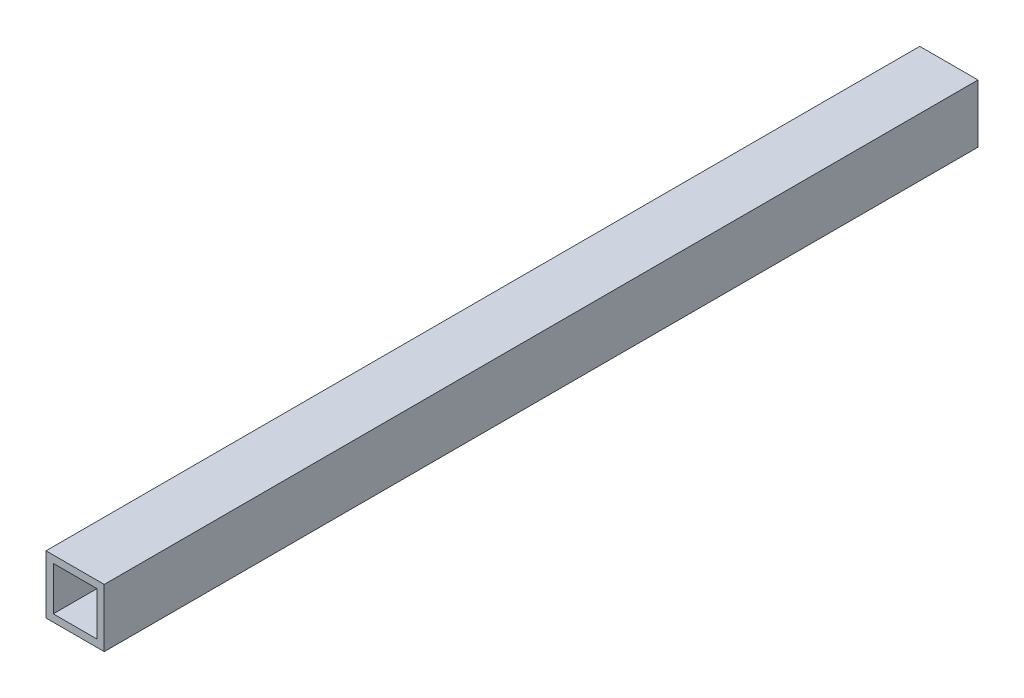
ISO-10303-21;
HEADER;
FILE_DESCRIPTION(('STEP AP214'),'2;1');
FILE_NAME('part.step','',(''),(''),'','','');
FILE_SCHEMA(('AUTOMOTIVE_DESIGN { 1 0 10303 214 1 1 1 1 }'));
ENDSEC;
DATA;
#1=APPLICATION_CONTEXT('core data for automotive mechanical design processes');
#2=APPLICATION_PROTOCOL_DEFINITION('international standard','automotive_design',2000,#1);
#3=PRODUCT_CONTEXT('',#1,'mechanical');
#4=PRODUCT('Part','Part','',(#3));
#5=PRODUCT_RELATED_PRODUCT_CATEGORY('part','',(#4));
#6=PRODUCT_DEFINITION_FORMATION('','',#4);
#7=PRODUCT_DEFINITION_CONTEXT('part definition',#1,'design');
#8=PRODUCT_DEFINITION('design','',#6,#7);
#9=PRODUCT_DEFINITION_SHAPE('','',#8);
#10=(LENGTH_UNIT() NAMED_UNIT(*) SI_UNIT(.MILLI.,.METRE.));
#11=(NAMED_UNIT(*) PLANE_ANGLE_UNIT() SI_UNIT($,.RADIAN.));
#12=(NAMED_UNIT(*) SI_UNIT($,.STERADIAN.) SOLID_ANGLE_UNIT());
#13=UNCERTAINTY_MEASURE_WITH_UNIT(LENGTH_MEASURE(1.E-05),#10,'distance_accuracy_value','');
#14=(GEOMETRIC_REPRESENTATION_CONTEXT(3) GLOBAL_UNCERTAINTY_ASSIGNED_CONTEXT((#13)) GLOBAL_UNIT_ASSIGNED_CONTEXT((#10,
#11,#12)) REPRESENTATION_CONTEXT('',''));
#15=CARTESIAN_POINT('',(0.,0.,0.));
#16=DIRECTION('',(0.,0.,1.));
#17=DIRECTION('',(1.,0.,0.));
#18=AXIS2_PLACEMENT_3D('',#15,#16,#17);
#19=CARTESIAN_POINT('',(0.,0.,-3048.));
#20=DIRECTION('',(-1.,0.,0.));
#21=DIRECTION('',(0.,0.,1.));
#22=AXIS2_PLACEMENT_3D('',#19,#20,#21);
#23=PLANE('',#22);
#24=DIRECTION('',(0.,-1.,0.));
#25=VECTOR('',#24,1.);
#26=CARTESIAN_POINT('',(0.,0.,0.));
#27=LINE('',#26,#25);
#28=CARTESIAN_POINT('',(0.,203.2,0.));
#29=VERTEX_POINT('',#28);
#30=CARTESIAN_POINT('',(0.,0.,0.));
#31=VERTEX_POINT('',#30);
#32=EDGE_CURVE('E140',#29,#31,#27,.T.);
#33=ORIENTED_EDGE('',*,*,#32,.F.);
#34=DIRECTION('',(0.,0.,1.));
#35=VECTOR('',#34,1.);
#36=CARTESIAN_POINT('',(0.,203.2,-3048.));
#37=LINE('',#36,#35);
#38=CARTESIAN_POINT('',(0.,203.2,-3048.));
#39=VERTEX_POINT('',#38);
#40=EDGE_CURVE('E11',#39,#29,#37,.T.);
#41=ORIENTED_EDGE('',*,*,#40,.F.);
#42=DIRECTION('',(0.,-1.,0.));
#43=VECTOR('',#42,1.);
#44=CARTESIAN_POINT('',(0.,0.,-3048.));
#45=LINE('',#44,#43);
#46=CARTESIAN_POINT('',(0.,0.,-3048.));
#47=VERTEX_POINT('',#46);
#48=EDGE_CURVE('E144',#39,#47,#45,.T.);
#49=ORIENTED_EDGE('',*,*,#48,.T.);
#50=DIRECTION('',(0.,0.,1.));
#51=VECTOR('',#50,1.);
#52=CARTESIAN_POINT('',(0.,0.,-3048.));
#53=LINE('',#52,#51);
#54=EDGE_CURVE('E36',#47,#31,#53,.T.);
#55=ORIENTED_EDGE('',*,*,#54,.T.);
#56=EDGE_LOOP('',(#33,#41,#49,#55));
#57=FACE_BOUND('',#56,.T.);
#58=ADVANCED_FACE('F33',(#57),#23,.T.);
#59=CARTESIAN_POINT('',(0.,203.2,-3048.));
#60=DIRECTION('',(0.,1.,0.));
#61=DIRECTION('',(0.,0.,1.));
#62=AXIS2_PLACEMENT_3D('',#59,#60,#61);
#63=PLANE('',#62);
#64=DIRECTION('',(-1.,0.,0.));
#65=VECTOR('',#64,1.);
#66=CARTESIAN_POINT('',(0.,203.2,0.));
#67=LINE('',#66,#65);
#68=CARTESIAN_POINT('',(203.2,203.2,0.));
#69=VERTEX_POINT('',#68);
#70=EDGE_CURVE('E147',#69,#29,#67,.T.);
#71=ORIENTED_EDGE('',*,*,#70,.F.);
#72=DIRECTION('',(0.,0.,1.));
#73=VECTOR('',#72,1.);
#74=CARTESIAN_POINT('',(203.2,203.2,-3048.));
#75=LINE('',#74,#73);
#76=CARTESIAN_POINT('',(203.2,203.2,-3048.));
#77=VERTEX_POINT('',#76);
#78=EDGE_CURVE('E41',#77,#69,#75,.T.);
#79=ORIENTED_EDGE('',*,*,#78,.F.);
#80=DIRECTION('',(-1.,0.,0.));
#81=VECTOR('',#80,1.);
#82=CARTESIAN_POINT('',(0.,203.2,-3048.));
#83=LINE('',#82,#81);
#84=EDGE_CURVE('E152',#77,#39,#83,.T.);
#85=ORIENTED_EDGE('',*,*,#84,.T.);
#86=ORIENTED_EDGE('',*,*,#40,.T.);
#87=EDGE_LOOP('',(#71,#79,#85,#86));
#88=FACE_BOUND('',#87,.T.);
#89=ADVANCED_FACE('F169',(#88),#63,.T.);
#90=CARTESIAN_POINT('',(203.2,0.,-3048.));
#91=DIRECTION('',(1.,0.,0.));
#92=DIRECTION('',(0.,0.,-1.));
#93=AXIS2_PLACEMENT_3D('',#90,#91,#92);
#94=PLANE('',#93);
#95=DIRECTION('',(0.,1.,0.));
#96=VECTOR('',#95,1.);
#97=CARTESIAN_POINT('',(203.2,0.,0.));
#98=LINE('',#97,#96);
#99=CARTESIAN_POINT('',(203.2,0.,0.));
#100=VERTEX_POINT('',#99);
#101=EDGE_CURVE('E159',#100,#69,#98,.T.);
#102=ORIENTED_EDGE('',*,*,#101,.F.);
#103=DIRECTION('',(0.,0.,1.));
#104=VECTOR('',#103,1.);
#105=CARTESIAN_POINT('',(203.2,0.,-3048.));
#106=LINE('',#105,#104);
#107=CARTESIAN_POINT('',(203.2,0.,-3048.));
#108=VERTEX_POINT('',#107);
#109=EDGE_CURVE('E164',#108,#100,#106,.T.);
#110=ORIENTED_EDGE('',*,*,#109,.F.);
#111=DIRECTION('',(0.,1.,0.));
#112=VECTOR('',#111,1.);
#113=CARTESIAN_POINT('',(203.2,0.,-3048.));
#114=LINE('',#113,#112);
#115=EDGE_CURVE('E149',#108,#77,#114,.T.);
#116=ORIENTED_EDGE('',*,*,#115,.T.);
#117=ORIENTED_EDGE('',*,*,#78,.T.);
#118=EDGE_LOOP('',(#102,#110,#116,#117));
#119=FACE_BOUND('',#118,.T.);
#120=ADVANCED_FACE('F173',(#119),#94,.T.);
#121=CARTESIAN_POINT('',(0.,0.,-3048.));
#122=DIRECTION('',(0.,-1.,0.));
#123=DIRECTION('',(0.,0.,-1.));
#124=AXIS2_PLACEMENT_3D('',#121,#122,#123);
#125=PLANE('',#124);
#126=DIRECTION('',(1.,0.,0.));
#127=VECTOR('',#126,1.);
#128=CARTESIAN_POINT('',(0.,0.,0.));
#129=LINE('',#128,#127);
#130=EDGE_CURVE('E156',#31,#100,#129,.T.);
#131=ORIENTED_EDGE('',*,*,#130,.F.);
#132=ORIENTED_EDGE('',*,*,#54,.F.);
#133=DIRECTION('',(1.,0.,0.));
#134=VECTOR('',#133,1.);
#135=CARTESIAN_POINT('',(0.,0.,-3048.));
#136=LINE('',#135,#134);
#137=EDGE_CURVE('E146',#47,#108,#136,.T.);
#138=ORIENTED_EDGE('',*,*,#137,.T.);
#139=ORIENTED_EDGE('',*,*,#109,.T.);
#140=EDGE_LOOP('',(#131,#132,#138,#139));
#141=FACE_BOUND('',#140,.T.);
#142=ADVANCED_FACE('F166',(#141),#125,.T.);
#143=CARTESIAN_POINT('',(0.,0.,-3048.));
#144=DIRECTION('',(0.,0.,-1.));
#145=DIRECTION('',(-1.,0.,0.));
#146=AXIS2_PLACEMENT_3D('',#143,#144,#145);
#147=PLANE('',#146);
#148=ORIENTED_EDGE('',*,*,#48,.F.);
#149=ORIENTED_EDGE('',*,*,#84,.F.);
#150=ORIENTED_EDGE('',*,*,#115,.F.);
#151=ORIENTED_EDGE('',*,*,#137,.F.);
#152=EDGE_LOOP('',(#148,#149,#150,#151));
#153=FACE_BOUND('',#152,.T.);
#154=ADVANCED_FACE('F175',(#153),#147,.T.);
#155=CARTESIAN_POINT('',(0.,0.,0.));
#156=DIRECTION('',(0.,0.,-1.));
#157=DIRECTION('',(-1.,0.,0.));
#158=AXIS2_PLACEMENT_3D('',#155,#156,#157);
#159=PLANE('',#158);
#160=DIRECTION('',(1.,0.,0.));
#161=VECTOR('',#160,1.);
#162=CARTESIAN_POINT('',(25.4,25.4,0.));
#163=LINE('',#162,#161);
#164=CARTESIAN_POINT('',(25.4,25.4,0.));
#165=VERTEX_POINT('',#164);
#166=CARTESIAN_POINT('',(177.8,25.4,0.));
#167=VERTEX_POINT('',#166);
#168=EDGE_CURVE('E134',#165,#167,#163,.T.);
#169=ORIENTED_EDGE('',*,*,#168,.F.);
#170=DIRECTION('',(0.,-1.,0.));
#171=VECTOR('',#170,1.);
#172=CARTESIAN_POINT('',(25.4,25.4,0.));
#173=LINE('',#172,#171);
#174=CARTESIAN_POINT('',(25.4,177.8,0.));
#175=VERTEX_POINT('',#174);
#176=EDGE_CURVE('E49',#175,#165,#173,.T.);
#177=ORIENTED_EDGE('',*,*,#176,.F.);
#178=DIRECTION('',(-1.,0.,0.));
#179=VECTOR('',#178,1.);
#180=CARTESIAN_POINT('',(25.4,177.8,0.));
#181=LINE('',#180,#179);
#182=CARTESIAN_POINT('',(177.8,177.8,0.));
#183=VERTEX_POINT('',#182);
#184=EDGE_CURVE('E125',#183,#175,#181,.T.);
#185=ORIENTED_EDGE('',*,*,#184,.F.);
#186=DIRECTION('',(0.,1.,0.));
#187=VECTOR('',#186,1.);
#188=CARTESIAN_POINT('',(177.8,25.4,0.));
#189=LINE('',#188,#187);
#190=EDGE_CURVE('E128',#167,#183,#189,.T.);
#191=ORIENTED_EDGE('',*,*,#190,.F.);
#192=EDGE_LOOP('',(#169,#177,#185,#191));
#193=FACE_BOUND('',#192,.T.);
#194=ORIENTED_EDGE('',*,*,#32,.T.);
#195=ORIENTED_EDGE('',*,*,#130,.T.);
#196=ORIENTED_EDGE('',*,*,#101,.T.);
#197=ORIENTED_EDGE('',*,*,#70,.T.);
#198=EDGE_LOOP('',(#194,#195,#196,#197));
#199=FACE_BOUND('',#198,.T.);
#200=ADVANCED_FACE('F168',(#193,#199),#159,.F.);
#201=CARTESIAN_POINT('',(25.4,25.4,-2438.4));
#202=DIRECTION('',(-1.,0.,0.));
#203=DIRECTION('',(0.,0.,1.));
#204=AXIS2_PLACEMENT_3D('',#201,#202,#203);
#205=PLANE('',#204);
#206=ORIENTED_EDGE('',*,*,#176,.T.);
#207=DIRECTION('',(0.,0.,1.));
#208=VECTOR('',#207,1.);
#209=CARTESIAN_POINT('',(25.4,25.4,-2438.4));
#210=LINE('',#209,#208);
#211=CARTESIAN_POINT('',(25.4,25.4,-2438.4));
#212=VERTEX_POINT('',#211);
#213=EDGE_CURVE('E103',#212,#165,#210,.T.);
#214=ORIENTED_EDGE('',*,*,#213,.F.);
#215=DIRECTION('',(0.,-1.,0.));
#216=VECTOR('',#215,1.);
#217=CARTESIAN_POINT('',(25.4,25.4,-2438.4));
#218=LINE('',#217,#216);
#219=CARTESIAN_POINT('',(25.4,177.8,-2438.4));
#220=VERTEX_POINT('',#219);
#221=EDGE_CURVE('E107',#220,#212,#218,.T.);
#222=ORIENTED_EDGE('',*,*,#221,.F.);
#223=DIRECTION('',(0.,0.,1.));
#224=VECTOR('',#223,1.);
#225=CARTESIAN_POINT('',(25.4,177.8,-2438.4));
#226=LINE('',#225,#224);
#227=EDGE_CURVE('E138',#220,#175,#226,.T.);
#228=ORIENTED_EDGE('',*,*,#227,.T.);
#229=EDGE_LOOP('',(#206,#214,#222,#228));
#230=FACE_BOUND('',#229,.T.);
#231=ADVANCED_FACE('F105',(#230),#205,.F.);
#232=CARTESIAN_POINT('',(25.4,177.8,-2438.4));
#233=DIRECTION('',(0.,1.,0.));
#234=DIRECTION('',(0.,0.,1.));
#235=AXIS2_PLACEMENT_3D('',#232,#233,#234);
#236=PLANE('',#235);
#237=ORIENTED_EDGE('',*,*,#184,.T.);
#238=ORIENTED_EDGE('',*,*,#227,.F.);
#239=DIRECTION('',(-1.,0.,0.));
#240=VECTOR('',#239,1.);
#241=CARTESIAN_POINT('',(25.4,177.8,-2438.4));
#242=LINE('',#241,#240);
#243=CARTESIAN_POINT('',(177.8,177.8,-2438.4));
#244=VERTEX_POINT('',#243);
#245=EDGE_CURVE('E113',#244,#220,#242,.T.);
#246=ORIENTED_EDGE('',*,*,#245,.F.);
#247=DIRECTION('',(0.,0.,1.));
#248=VECTOR('',#247,1.);
#249=CARTESIAN_POINT('',(177.8,177.8,-2438.4));
#250=LINE('',#249,#248);
#251=EDGE_CURVE('E141',#244,#183,#250,.T.);
#252=ORIENTED_EDGE('',*,*,#251,.T.);
#253=EDGE_LOOP('',(#237,#238,#246,#252));
#254=FACE_BOUND('',#253,.T.);
#255=ADVANCED_FACE('F219',(#254),#236,.F.);
#256=CARTESIAN_POINT('',(177.8,25.4,-2438.4));
#257=DIRECTION('',(1.,0.,0.));
#258=DIRECTION('',(0.,0.,-1.));
#259=AXIS2_PLACEMENT_3D('',#256,#257,#258);
#260=PLANE('',#259);
#261=ORIENTED_EDGE('',*,*,#190,.T.);
#262=ORIENTED_EDGE('',*,*,#251,.F.);
#263=DIRECTION('',(0.,1.,0.));
#264=VECTOR('',#263,1.);
#265=CARTESIAN_POINT('',(177.8,25.4,-2438.4));
#266=LINE('',#265,#264);
#267=CARTESIAN_POINT('',(177.8,25.4,-2438.4));
#268=VERTEX_POINT('',#267);
#269=EDGE_CURVE('E121',#268,#244,#266,.T.);
#270=ORIENTED_EDGE('',*,*,#269,.F.);
#271=DIRECTION('',(0.,0.,1.));
#272=VECTOR('',#271,1.);
#273=CARTESIAN_POINT('',(177.8,25.4,-2438.4));
#274=LINE('',#273,#272);
#275=EDGE_CURVE('E112',#268,#167,#274,.T.);
#276=ORIENTED_EDGE('',*,*,#275,.T.);
#277=EDGE_LOOP('',(#261,#262,#270,#276));
#278=FACE_BOUND('',#277,.T.);
#279=ADVANCED_FACE('F227',(#278),#260,.F.);
#280=CARTESIAN_POINT('',(25.4,25.4,-2438.4));
#281=DIRECTION('',(0.,-1.,0.));
#282=DIRECTION('',(0.,0.,-1.));
#283=AXIS2_PLACEMENT_3D('',#280,#281,#282);
#284=PLANE('',#283);
#285=ORIENTED_EDGE('',*,*,#168,.T.);
#286=ORIENTED_EDGE('',*,*,#275,.F.);
#287=DIRECTION('',(1.,0.,0.));
#288=VECTOR('',#287,1.);
#289=CARTESIAN_POINT('',(25.4,25.4,-2438.4));
#290=LINE('',#289,#288);
#291=EDGE_CURVE('E116',#212,#268,#290,.T.);
#292=ORIENTED_EDGE('',*,*,#291,.F.);
#293=ORIENTED_EDGE('',*,*,#213,.T.);
#294=EDGE_LOOP('',(#285,#286,#292,#293));
#295=FACE_BOUND('',#294,.T.);
#296=ADVANCED_FACE('F117',(#295),#284,.F.);
#297=CARTESIAN_POINT('',(0.,0.,-2438.4));
#298=DIRECTION('',(0.,0.,-1.));
#299=DIRECTION('',(-1.,0.,0.));
#300=AXIS2_PLACEMENT_3D('',#297,#298,#299);
#301=PLANE('',#300);
#302=ORIENTED_EDGE('',*,*,#221,.T.);
#303=ORIENTED_EDGE('',*,*,#291,.T.);
#304=ORIENTED_EDGE('',*,*,#269,.T.);
#305=ORIENTED_EDGE('',*,*,#245,.T.);
#306=EDGE_LOOP('',(#302,#303,#304,#305));
#307=FACE_BOUND('',#306,.T.);
#308=ADVANCED_FACE('F123',(#307),#301,.F.);
#309=CLOSED_SHELL('',(#58,#89,#120,#142,#154,#200,#231,#255,#279,#296,#308));
#310=MANIFOLD_SOLID_BREP('B2',#309);
#311=ADVANCED_BREP_SHAPE_REPRESENTATION('',(#18,#310),#14);
#312=SHAPE_DEFINITION_REPRESENTATION(#9,#311);
ENDSEC;
END-ISO-10303-21;
